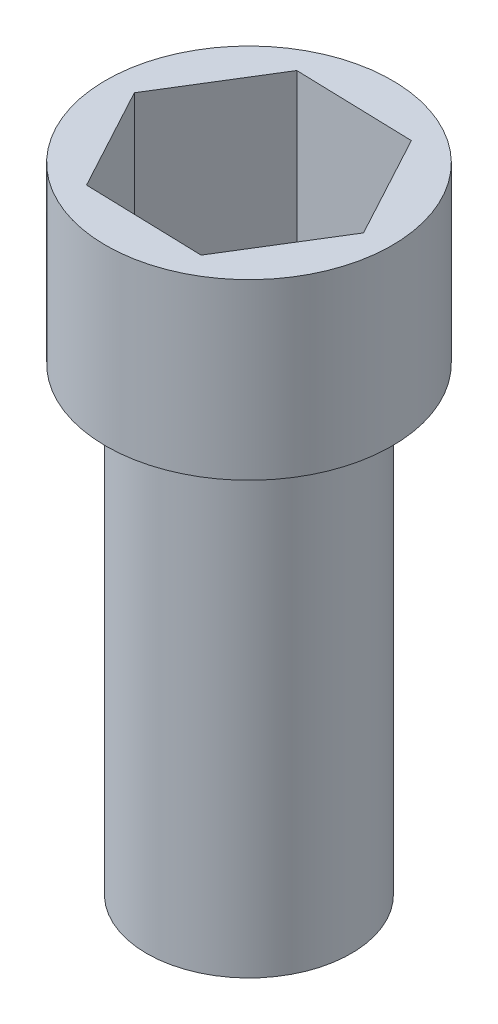
ISO-10303-21;
HEADER;
FILE_DESCRIPTION(('STEP AP214'),'2;1');
FILE_NAME('part.step','',(''),(''),'','','');
FILE_SCHEMA(('AUTOMOTIVE_DESIGN { 1 0 10303 214 1 1 1 1 }'));
ENDSEC;
DATA;
#1=APPLICATION_CONTEXT('core data for automotive mechanical design processes');
#2=APPLICATION_PROTOCOL_DEFINITION('international standard','automotive_design',2000,#1);
#3=PRODUCT_CONTEXT('',#1,'mechanical');
#4=PRODUCT('Part','Part','',(#3));
#5=PRODUCT_RELATED_PRODUCT_CATEGORY('part','',(#4));
#6=PRODUCT_DEFINITION_FORMATION('','',#4);
#7=PRODUCT_DEFINITION_CONTEXT('part definition',#1,'design');
#8=PRODUCT_DEFINITION('design','',#6,#7);
#9=PRODUCT_DEFINITION_SHAPE('','',#8);
#10=(LENGTH_UNIT() NAMED_UNIT(*) SI_UNIT(.MILLI.,.METRE.));
#11=(NAMED_UNIT(*) PLANE_ANGLE_UNIT() SI_UNIT($,.RADIAN.));
#12=(NAMED_UNIT(*) SI_UNIT($,.STERADIAN.) SOLID_ANGLE_UNIT());
#13=UNCERTAINTY_MEASURE_WITH_UNIT(LENGTH_MEASURE(1.E-05),#10,'distance_accuracy_value','');
#14=(GEOMETRIC_REPRESENTATION_CONTEXT(3) GLOBAL_UNCERTAINTY_ASSIGNED_CONTEXT((#13)) GLOBAL_UNIT_ASSIGNED_CONTEXT((#10,
#11,#12)) REPRESENTATION_CONTEXT('',''));
#15=CARTESIAN_POINT('',(0.,0.,0.));
#16=DIRECTION('',(0.,0.,1.));
#17=DIRECTION('',(1.,0.,0.));
#18=AXIS2_PLACEMENT_3D('',#15,#16,#17);
#19=CARTESIAN_POINT('',(0.,45.,0.));
#20=DIRECTION('',(0.,-1.,0.));
#21=DIRECTION('',(0.,0.,-1.));
#22=AXIS2_PLACEMENT_3D('',#19,#20,#21);
#23=CYLINDRICAL_SURFACE('',#22,10.);
#24=CARTESIAN_POINT('',(0.,45.,0.));
#25=DIRECTION('',(0.,1.,0.));
#26=DIRECTION('',(0.,0.,1.));
#27=AXIS2_PLACEMENT_3D('',#24,#25,#26);
#28=CIRCLE('',#27,10.);
#29=CARTESIAN_POINT('',(0.,45.,10.));
#30=VERTEX_POINT('',#29);
#31=EDGE_CURVE('E11',#30,#30,#28,.T.);
#32=ORIENTED_EDGE('',*,*,#31,.F.);
#33=EDGE_LOOP('',(#32));
#34=FACE_BOUND('',#33,.T.);
#35=CARTESIAN_POINT('',(0.,0.,0.));
#36=DIRECTION('',(0.,1.,0.));
#37=DIRECTION('',(0.,0.,1.));
#38=AXIS2_PLACEMENT_3D('',#35,#36,#37);
#39=CIRCLE('',#38,10.);
#40=CARTESIAN_POINT('',(0.,0.,10.));
#41=VERTEX_POINT('',#40);
#42=EDGE_CURVE('E46',#41,#41,#39,.T.);
#43=ORIENTED_EDGE('',*,*,#42,.T.);
#44=EDGE_LOOP('',(#43));
#45=FACE_BOUND('',#44,.T.);
#46=ADVANCED_FACE('F43',(#34,#45),#23,.T.);
#47=CARTESIAN_POINT('',(0.,0.,0.));
#48=DIRECTION('',(0.,1.,0.));
#49=DIRECTION('',(0.,0.,1.));
#50=AXIS2_PLACEMENT_3D('',#47,#48,#49);
#51=PLANE('',#50);
#52=ORIENTED_EDGE('',*,*,#42,.F.);
#53=EDGE_LOOP('',(#52));
#54=FACE_BOUND('',#53,.T.);
#55=ADVANCED_FACE('F178',(#54),#51,.F.);
#56=CARTESIAN_POINT('',(0.,47.,0.));
#57=DIRECTION('',(0.,-1.,0.));
#58=DIRECTION('',(0.,0.,-1.));
#59=AXIS2_PLACEMENT_3D('',#56,#57,#58);
#60=CYLINDRICAL_SURFACE('',#59,14.);
#61=CARTESIAN_POINT('',(0.,45.,0.));
#62=DIRECTION('',(0.,1.,0.));
#63=DIRECTION('',(0.,0.,1.));
#64=AXIS2_PLACEMENT_3D('',#61,#62,#63);
#65=CIRCLE('',#64,14.);
#66=CARTESIAN_POINT('',(0.,45.,14.));
#67=VERTEX_POINT('',#66);
#68=EDGE_CURVE('E168',#67,#67,#65,.T.);
#69=ORIENTED_EDGE('',*,*,#68,.T.);
#70=EDGE_LOOP('',(#69));
#71=FACE_BOUND('',#70,.T.);
#72=CARTESIAN_POINT('',(0.,62.,0.));
#73=DIRECTION('',(0.,1.,0.));
#74=DIRECTION('',(0.,0.,1.));
#75=AXIS2_PLACEMENT_3D('',#72,#73,#74);
#76=CIRCLE('',#75,14.);
#77=CARTESIAN_POINT('',(0.,62.,14.));
#78=VERTEX_POINT('',#77);
#79=EDGE_CURVE('E112',#78,#78,#76,.T.);
#80=ORIENTED_EDGE('',*,*,#79,.F.);
#81=EDGE_LOOP('',(#80));
#82=FACE_BOUND('',#81,.T.);
#83=ADVANCED_FACE('F180',(#71,#82),#60,.T.);
#84=CARTESIAN_POINT('',(0.,45.,0.));
#85=DIRECTION('',(0.,1.,0.));
#86=DIRECTION('',(0.,0.,1.));
#87=AXIS2_PLACEMENT_3D('',#84,#85,#86);
#88=PLANE('',#87);
#89=ORIENTED_EDGE('',*,*,#31,.T.);
#90=EDGE_LOOP('',(#89));
#91=FACE_BOUND('',#90,.T.);
#92=ORIENTED_EDGE('',*,*,#68,.F.);
#93=EDGE_LOOP('',(#92));
#94=FACE_BOUND('',#93,.T.);
#95=ADVANCED_FACE('F185',(#91,#94),#88,.F.);
#96=CARTESIAN_POINT('',(0.,62.,0.));
#97=DIRECTION('',(0.,1.,0.));
#98=DIRECTION('',(0.,0.,1.));
#99=AXIS2_PLACEMENT_3D('',#96,#97,#98);
#100=PLANE('',#99);
#101=ORIENTED_EDGE('',*,*,#79,.T.);
#102=EDGE_LOOP('',(#101));
#103=FACE_BOUND('',#102,.T.);
#104=DIRECTION('',(-0.47486967590371,0.,-0.880056129407156));
#105=VECTOR('',#104,1.);
#106=CARTESIAN_POINT('',(11.5422226462015,62.,0.332309673114916));
#107=LINE('',#106,#105);
#108=CARTESIAN_POINT('',(11.5422226462015,62.,0.332309673114916));
#109=VERTEX_POINT('',#108);
#110=CARTESIAN_POINT('',(6.05889994194159,62.,-9.82970319118912));
#111=VERTEX_POINT('',#110);
#112=EDGE_CURVE('E105',#109,#111,#107,.T.);
#113=ORIENTED_EDGE('',*,*,#112,.F.);
#114=DIRECTION('',(0.524716126870947,0.,-0.851277267523074));
#115=VECTOR('',#114,1.);
#116=CARTESIAN_POINT('',(5.48332270425995,62.,10.162012864304));
#117=LINE('',#116,#115);
#118=CARTESIAN_POINT('',(5.48332270425995,62.,10.162012864304));
#119=VERTEX_POINT('',#118);
#120=EDGE_CURVE('E95',#119,#109,#117,.T.);
#121=ORIENTED_EDGE('',*,*,#120,.F.);
#122=DIRECTION('',(0.999585802774658,0.,0.0287788618840821));
#123=VECTOR('',#122,1.);
#124=CARTESIAN_POINT('',(-6.05889994194159,62.,9.82970319118912));
#125=LINE('',#124,#123);
#126=CARTESIAN_POINT('',(-6.05889994194159,62.,9.82970319118912));
#127=VERTEX_POINT('',#126);
#128=EDGE_CURVE('E131',#127,#119,#125,.T.);
#129=ORIENTED_EDGE('',*,*,#128,.F.);
#130=DIRECTION('',(0.47486967590371,0.,0.880056129407156));
#131=VECTOR('',#130,1.);
#132=CARTESIAN_POINT('',(-11.5422226462015,62.,-0.332309673114917));
#133=LINE('',#132,#131);
#134=CARTESIAN_POINT('',(-11.5422226462015,62.,-0.332309673114917));
#135=VERTEX_POINT('',#134);
#136=EDGE_CURVE('E127',#135,#127,#133,.T.);
#137=ORIENTED_EDGE('',*,*,#136,.F.);
#138=DIRECTION('',(-0.524716126870948,0.,0.851277267523074));
#139=VECTOR('',#138,1.);
#140=CARTESIAN_POINT('',(-5.48332270425995,62.,-10.162012864304));
#141=LINE('',#140,#139);
#142=CARTESIAN_POINT('',(-5.48332270425995,62.,-10.162012864304));
#143=VERTEX_POINT('',#142);
#144=EDGE_CURVE('E122',#143,#135,#141,.T.);
#145=ORIENTED_EDGE('',*,*,#144,.F.);
#146=DIRECTION('',(-0.999585802774658,0.,-0.0287788618840821));
#147=VECTOR('',#146,1.);
#148=CARTESIAN_POINT('',(6.05889994194159,62.,-9.82970319118912));
#149=LINE('',#148,#147);
#150=EDGE_CURVE('E118',#111,#143,#149,.T.);
#151=ORIENTED_EDGE('',*,*,#150,.F.);
#152=EDGE_LOOP('',(#113,#121,#129,#137,#145,#151));
#153=FACE_BOUND('',#152,.T.);
#154=ADVANCED_FACE('F116',(#103,#153),#100,.T.);
#155=CARTESIAN_POINT('',(5.48332270425995,62.,10.162012864304));
#156=DIRECTION('',(-0.851277267523074,0.,-0.524716126870947));
#157=DIRECTION('',(-0.524716126870947,0.,0.851277267523074));
#158=AXIS2_PLACEMENT_3D('',#155,#156,#157);
#159=PLANE('',#158);
#160=DIRECTION('',(0.524716126870947,0.,-0.851277267523074));
#161=VECTOR('',#160,1.);
#162=CARTESIAN_POINT('',(5.48332270425995,47.,10.162012864304));
#163=LINE('',#162,#161);
#164=CARTESIAN_POINT('',(5.48332270425995,47.,10.162012864304));
#165=VERTEX_POINT('',#164);
#166=CARTESIAN_POINT('',(11.5422226462015,47.,0.332309673114916));
#167=VERTEX_POINT('',#166);
#168=EDGE_CURVE('E58',#165,#167,#163,.T.);
#169=ORIENTED_EDGE('',*,*,#168,.F.);
#170=DIRECTION('',(0.,-1.,0.));
#171=VECTOR('',#170,1.);
#172=CARTESIAN_POINT('',(5.48332270425995,62.,10.162012864304));
#173=LINE('',#172,#171);
#174=EDGE_CURVE('E100',#119,#165,#173,.T.);
#175=ORIENTED_EDGE('',*,*,#174,.F.);
#176=ORIENTED_EDGE('',*,*,#120,.T.);
#177=DIRECTION('',(0.,-1.,0.));
#178=VECTOR('',#177,1.);
#179=CARTESIAN_POINT('',(11.5422226462015,62.,0.332309673114916));
#180=LINE('',#179,#178);
#181=EDGE_CURVE('E98',#109,#167,#180,.T.);
#182=ORIENTED_EDGE('',*,*,#181,.T.);
#183=EDGE_LOOP('',(#169,#175,#176,#182));
#184=FACE_BOUND('',#183,.T.);
#185=ADVANCED_FACE('F97',(#184),#159,.T.);
#186=CARTESIAN_POINT('',(11.5422226462015,62.,0.332309673114916));
#187=DIRECTION('',(-0.880056129407156,0.,0.47486967590371));
#188=DIRECTION('',(0.47486967590371,0.,0.880056129407156));
#189=AXIS2_PLACEMENT_3D('',#186,#187,#188);
#190=PLANE('',#189);
#191=DIRECTION('',(-0.47486967590371,0.,-0.880056129407156));
#192=VECTOR('',#191,1.);
#193=CARTESIAN_POINT('',(11.5422226462015,47.,0.332309673114916));
#194=LINE('',#193,#192);
#195=CARTESIAN_POINT('',(6.05889994194159,47.,-9.82970319118912));
#196=VERTEX_POINT('',#195);
#197=EDGE_CURVE('E62',#167,#196,#194,.T.);
#198=ORIENTED_EDGE('',*,*,#197,.F.);
#199=ORIENTED_EDGE('',*,*,#181,.F.);
#200=ORIENTED_EDGE('',*,*,#112,.T.);
#201=DIRECTION('',(0.,-1.,0.));
#202=VECTOR('',#201,1.);
#203=CARTESIAN_POINT('',(6.05889994194159,62.,-9.82970319118912));
#204=LINE('',#203,#202);
#205=EDGE_CURVE('E113',#111,#196,#204,.T.);
#206=ORIENTED_EDGE('',*,*,#205,.T.);
#207=EDGE_LOOP('',(#198,#199,#200,#206));
#208=FACE_BOUND('',#207,.T.);
#209=ADVANCED_FACE('F109',(#208),#190,.T.);
#210=CARTESIAN_POINT('',(6.05889994194159,62.,-9.82970319118912));
#211=DIRECTION('',(-0.0287788618840821,0.,0.999585802774658));
#212=DIRECTION('',(0.999585802774658,0.,0.0287788618840821));
#213=AXIS2_PLACEMENT_3D('',#210,#211,#212);
#214=PLANE('',#213);
#215=DIRECTION('',(-0.999585802774658,0.,-0.0287788618840821));
#216=VECTOR('',#215,1.);
#217=CARTESIAN_POINT('',(6.05889994194159,47.,-9.82970319118912));
#218=LINE('',#217,#216);
#219=CARTESIAN_POINT('',(-5.48332270425995,47.,-10.162012864304));
#220=VERTEX_POINT('',#219);
#221=EDGE_CURVE('E138',#196,#220,#218,.T.);
#222=ORIENTED_EDGE('',*,*,#221,.F.);
#223=ORIENTED_EDGE('',*,*,#205,.F.);
#224=ORIENTED_EDGE('',*,*,#150,.T.);
#225=DIRECTION('',(0.,-1.,0.));
#226=VECTOR('',#225,1.);
#227=CARTESIAN_POINT('',(-5.48332270425995,62.,-10.162012864304));
#228=LINE('',#227,#226);
#229=EDGE_CURVE('E159',#143,#220,#228,.T.);
#230=ORIENTED_EDGE('',*,*,#229,.T.);
#231=EDGE_LOOP('',(#222,#223,#224,#230));
#232=FACE_BOUND('',#231,.T.);
#233=ADVANCED_FACE('F203',(#232),#214,.T.);
#234=CARTESIAN_POINT('',(-5.48332270425995,62.,-10.162012864304));
#235=DIRECTION('',(0.851277267523074,0.,0.524716126870948));
#236=DIRECTION('',(0.524716126870948,0.,-0.851277267523074));
#237=AXIS2_PLACEMENT_3D('',#234,#235,#236);
#238=PLANE('',#237);
#239=DIRECTION('',(-0.524716126870948,0.,0.851277267523074));
#240=VECTOR('',#239,1.);
#241=CARTESIAN_POINT('',(-5.48332270425995,47.,-10.162012864304));
#242=LINE('',#241,#240);
#243=CARTESIAN_POINT('',(-11.5422226462015,47.,-0.332309673114917));
#244=VERTEX_POINT('',#243);
#245=EDGE_CURVE('E141',#220,#244,#242,.T.);
#246=ORIENTED_EDGE('',*,*,#245,.F.);
#247=ORIENTED_EDGE('',*,*,#229,.F.);
#248=ORIENTED_EDGE('',*,*,#144,.T.);
#249=DIRECTION('',(0.,-1.,0.));
#250=VECTOR('',#249,1.);
#251=CARTESIAN_POINT('',(-11.5422226462015,62.,-0.332309673114917));
#252=LINE('',#251,#250);
#253=EDGE_CURVE('E155',#135,#244,#252,.T.);
#254=ORIENTED_EDGE('',*,*,#253,.T.);
#255=EDGE_LOOP('',(#246,#247,#248,#254));
#256=FACE_BOUND('',#255,.T.);
#257=ADVANCED_FACE('F206',(#256),#238,.T.);
#258=CARTESIAN_POINT('',(-11.5422226462015,62.,-0.332309673114917));
#259=DIRECTION('',(0.880056129407156,0.,-0.47486967590371));
#260=DIRECTION('',(-0.47486967590371,0.,-0.880056129407156));
#261=AXIS2_PLACEMENT_3D('',#258,#259,#260);
#262=PLANE('',#261);
#263=DIRECTION('',(0.47486967590371,0.,0.880056129407156));
#264=VECTOR('',#263,1.);
#265=CARTESIAN_POINT('',(-11.5422226462015,47.,-0.332309673114917));
#266=LINE('',#265,#264);
#267=CARTESIAN_POINT('',(-6.05889994194159,47.,9.82970319118912));
#268=VERTEX_POINT('',#267);
#269=EDGE_CURVE('E144',#244,#268,#266,.T.);
#270=ORIENTED_EDGE('',*,*,#269,.F.);
#271=ORIENTED_EDGE('',*,*,#253,.F.);
#272=ORIENTED_EDGE('',*,*,#136,.T.);
#273=DIRECTION('',(0.,-1.,0.));
#274=VECTOR('',#273,1.);
#275=CARTESIAN_POINT('',(-6.05889994194159,62.,9.82970319118912));
#276=LINE('',#275,#274);
#277=EDGE_CURVE('E151',#127,#268,#276,.T.);
#278=ORIENTED_EDGE('',*,*,#277,.T.);
#279=EDGE_LOOP('',(#270,#271,#272,#278));
#280=FACE_BOUND('',#279,.T.);
#281=ADVANCED_FACE('F210',(#280),#262,.T.);
#282=CARTESIAN_POINT('',(-6.05889994194159,62.,9.82970319118912));
#283=DIRECTION('',(0.0287788618840821,0.,-0.999585802774658));
#284=DIRECTION('',(-0.999585802774658,0.,-0.0287788618840821));
#285=AXIS2_PLACEMENT_3D('',#282,#283,#284);
#286=PLANE('',#285);
#287=DIRECTION('',(0.999585802774658,0.,0.0287788618840821));
#288=VECTOR('',#287,1.);
#289=CARTESIAN_POINT('',(-6.05889994194159,47.,9.82970319118912));
#290=LINE('',#289,#288);
#291=EDGE_CURVE('E106',#268,#165,#290,.T.);
#292=ORIENTED_EDGE('',*,*,#291,.F.);
#293=ORIENTED_EDGE('',*,*,#277,.F.);
#294=ORIENTED_EDGE('',*,*,#128,.T.);
#295=ORIENTED_EDGE('',*,*,#174,.T.);
#296=EDGE_LOOP('',(#292,#293,#294,#295));
#297=FACE_BOUND('',#296,.T.);
#298=ADVANCED_FACE('F195',(#297),#286,.T.);
#299=CARTESIAN_POINT('',(0.,47.,0.));
#300=DIRECTION('',(0.,1.,0.));
#301=DIRECTION('',(0.,0.,1.));
#302=AXIS2_PLACEMENT_3D('',#299,#300,#301);
#303=PLANE('',#302);
#304=ORIENTED_EDGE('',*,*,#168,.T.);
#305=ORIENTED_EDGE('',*,*,#197,.T.);
#306=ORIENTED_EDGE('',*,*,#221,.T.);
#307=ORIENTED_EDGE('',*,*,#245,.T.);
#308=ORIENTED_EDGE('',*,*,#269,.T.);
#309=ORIENTED_EDGE('',*,*,#291,.T.);
#310=EDGE_LOOP('',(#304,#305,#306,#307,#308,#309));
#311=FACE_BOUND('',#310,.T.);
#312=ADVANCED_FACE('F192',(#311),#303,.T.);
#313=CLOSED_SHELL('',(#46,#55,#83,#95,#154,#185,#209,#233,#257,#281,#298,#312));
#314=MANIFOLD_SOLID_BREP('B2',#313);
#315=ADVANCED_BREP_SHAPE_REPRESENTATION('',(#18,#314),#14);
#316=SHAPE_DEFINITION_REPRESENTATION(#9,#315);
ENDSEC;
END-ISO-10303-21;
